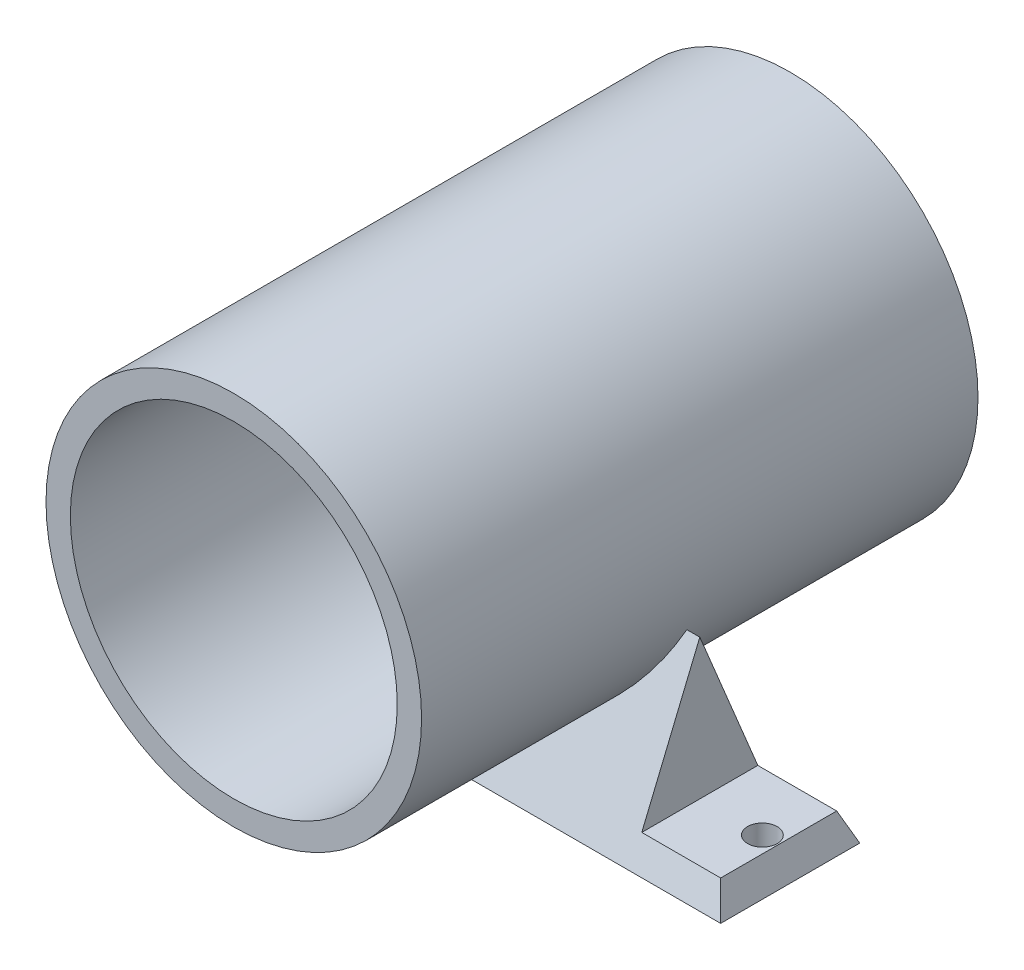
ISO-10303-21;
HEADER;
FILE_DESCRIPTION(('STEP AP214'),'2;1');
FILE_NAME('part.step','',(''),(''),'','','');
FILE_SCHEMA(('AUTOMOTIVE_DESIGN { 1 0 10303 214 1 1 1 1 }'));
ENDSEC;
DATA;
#1=APPLICATION_CONTEXT('core data for automotive mechanical design processes');
#2=APPLICATION_PROTOCOL_DEFINITION('international standard','automotive_design',2000,#1);
#3=PRODUCT_CONTEXT('',#1,'mechanical');
#4=PRODUCT('Part','Part','',(#3));
#5=PRODUCT_RELATED_PRODUCT_CATEGORY('part','',(#4));
#6=PRODUCT_DEFINITION_FORMATION('','',#4);
#7=PRODUCT_DEFINITION_CONTEXT('part definition',#1,'design');
#8=PRODUCT_DEFINITION('design','',#6,#7);
#9=PRODUCT_DEFINITION_SHAPE('','',#8);
#10=(LENGTH_UNIT() NAMED_UNIT(*) SI_UNIT(.MILLI.,.METRE.));
#11=(NAMED_UNIT(*) PLANE_ANGLE_UNIT() SI_UNIT($,.RADIAN.));
#12=(NAMED_UNIT(*) SI_UNIT($,.STERADIAN.) SOLID_ANGLE_UNIT());
#13=UNCERTAINTY_MEASURE_WITH_UNIT(LENGTH_MEASURE(1.E-05),#10,'distance_accuracy_value','');
#14=(GEOMETRIC_REPRESENTATION_CONTEXT(3) GLOBAL_UNCERTAINTY_ASSIGNED_CONTEXT((#13)) GLOBAL_UNIT_ASSIGNED_CONTEXT((#10,
#11,#12)) REPRESENTATION_CONTEXT('',''));
#15=CARTESIAN_POINT('',(0.,0.,0.));
#16=DIRECTION('',(0.,0.,1.));
#17=DIRECTION('',(1.,0.,0.));
#18=AXIS2_PLACEMENT_3D('',#15,#16,#17);
#19=CARTESIAN_POINT('',(-63.5,-53.975,-15.875));
#20=DIRECTION('',(0.,0.382683432365091,-0.923879532511286));
#21=DIRECTION('',(0.,0.923879532511287,0.382683432365091));
#22=AXIS2_PLACEMENT_3D('',#19,#20,#21);
#23=PLANE('',#22);
#24=DIRECTION('',(0.,-0.923879532511287,-0.382683432365091));
#25=VECTOR('',#24,1.);
#26=CARTESIAN_POINT('',(42.8625,-53.975,-15.875));
#27=LINE('',#26,#25);
#28=CARTESIAN_POINT('',(42.8625,-47.625,-13.2447438789308));
#29=VERTEX_POINT('',#28);
#30=CARTESIAN_POINT('',(42.8625,-15.6493596973272,0.));
#31=VERTEX_POINT('',#30);
#32=EDGE_CURVE('E185',#29,#31,#27,.F.);
#33=ORIENTED_EDGE('',*,*,#32,.F.);
#34=DIRECTION('',(1.,0.,0.));
#35=VECTOR('',#34,1.);
#36=CARTESIAN_POINT('',(-63.5,-47.625,-13.2447438789308));
#37=LINE('',#36,#35);
#38=CARTESIAN_POINT('',(60.8697438789308,-47.625,-13.2447438789308));
#39=VERTEX_POINT('',#38);
#40=EDGE_CURVE('E193',#39,#29,#37,.F.);
#41=ORIENTED_EDGE('',*,*,#40,.F.);
#42=DIRECTION('',(0.357406744336594,-0.862856209461016,-0.357406744336594));
#43=VECTOR('',#42,1.);
#44=CARTESIAN_POINT('',(47.277073226045,-14.8093901609323,0.347926773954999));
#45=LINE('',#44,#43);
#46=CARTESIAN_POINT('',(63.5,-53.975,-15.875));
#47=VERTEX_POINT('',#46);
#48=EDGE_CURVE('E160',#39,#47,#45,.T.);
#49=ORIENTED_EDGE('',*,*,#48,.T.);
#50=DIRECTION('',(-1.,0.,0.));
#51=VECTOR('',#50,1.);
#52=CARTESIAN_POINT('',(-63.5,-53.975,-15.875));
#53=LINE('',#52,#51);
#54=CARTESIAN_POINT('',(-63.5,-53.975,-15.875));
#55=VERTEX_POINT('',#54);
#56=EDGE_CURVE('E177',#47,#55,#53,.T.);
#57=ORIENTED_EDGE('',*,*,#56,.T.);
#58=DIRECTION('',(-0.357406744336594,-0.862856209461016,-0.357406744336594));
#59=VECTOR('',#58,1.);
#60=CARTESIAN_POINT('',(-63.5,-53.975,-15.875));
#61=LINE('',#60,#59);
#62=CARTESIAN_POINT('',(-60.8697438789309,-47.625,-13.2447438789308));
#63=VERTEX_POINT('',#62);
#64=EDGE_CURVE('E157',#63,#55,#61,.T.);
#65=ORIENTED_EDGE('',*,*,#64,.F.);
#66=DIRECTION('',(-1.,0.,0.));
#67=VECTOR('',#66,1.);
#68=CARTESIAN_POINT('',(-63.5,-47.625,-13.2447438789308));
#69=LINE('',#68,#67);
#70=CARTESIAN_POINT('',(-42.8625,-47.625,-13.2447438789308));
#71=VERTEX_POINT('',#70);
#72=EDGE_CURVE('E63',#63,#71,#69,.F.);
#73=ORIENTED_EDGE('',*,*,#72,.T.);
#74=DIRECTION('',(0.,0.923879532511287,0.382683432365091));
#75=VECTOR('',#74,1.);
#76=CARTESIAN_POINT('',(-42.8625,-53.975,-15.875));
#77=LINE('',#76,#75);
#78=CARTESIAN_POINT('',(-42.8625,-15.6493596973272,0.));
#79=VERTEX_POINT('',#78);
#80=EDGE_CURVE('E118',#79,#71,#77,.F.);
#81=ORIENTED_EDGE('',*,*,#80,.F.);
#82=DIRECTION('',(1.,0.,0.));
#83=VECTOR('',#82,1.);
#84=CARTESIAN_POINT('',(-63.5,-15.6493596973272,0.));
#85=LINE('',#84,#83);
#86=CARTESIAN_POINT('',(-39.9035267528282,-15.6493596973272,0.));
#87=VERTEX_POINT('',#86);
#88=EDGE_CURVE('E126',#79,#87,#85,.T.);
#89=ORIENTED_EDGE('',*,*,#88,.T.);
#90=CARTESIAN_POINT('',(0.,0.,6.48217702908786));
#91=DIRECTION('',(0.,0.382683432365091,-0.923879532511286));
#92=DIRECTION('',(0.,-0.923879532511287,-0.382683432365091));
#93=AXIS2_PLACEMENT_3D('',#90,#91,#92);
#94=ELLIPSE('',#93,46.3940356850328,42.8625);
#95=CARTESIAN_POINT('',(39.9035267528281,-15.6493596973272,0.));
#96=VERTEX_POINT('',#95);
#97=EDGE_CURVE('E153',#96,#87,#94,.T.);
#98=ORIENTED_EDGE('',*,*,#97,.F.);
#99=EDGE_CURVE('E156',#96,#31,#85,.T.);
#100=ORIENTED_EDGE('',*,*,#99,.T.);
#101=EDGE_LOOP('',(#33,#41,#49,#57,#65,#73,#81,#89,#98,#100));
#102=FACE_BOUND('',#101,.T.);
#103=ADVANCED_FACE('F39',(#102),#23,.T.);
#104=CARTESIAN_POINT('',(-63.5,-53.975,15.875));
#105=DIRECTION('',(0.,0.382683432365091,0.923879532511286));
#106=DIRECTION('',(0.,-0.923879532511287,0.382683432365091));
#107=AXIS2_PLACEMENT_3D('',#104,#105,#106);
#108=PLANE('',#107);
#109=DIRECTION('',(0.,0.923879532511287,-0.382683432365091));
#110=VECTOR('',#109,1.);
#111=CARTESIAN_POINT('',(42.8625,-53.975,15.875));
#112=LINE('',#111,#110);
#113=CARTESIAN_POINT('',(42.8625,-47.625,13.2447438789308));
#114=VERTEX_POINT('',#113);
#115=EDGE_CURVE('E11',#31,#114,#112,.F.);
#116=ORIENTED_EDGE('',*,*,#115,.F.);
#117=ORIENTED_EDGE('',*,*,#99,.F.);
#118=CARTESIAN_POINT('',(0.,0.,-6.48217702908785));
#119=DIRECTION('',(0.,0.382683432365091,0.923879532511286));
#120=DIRECTION('',(0.,0.923879532511287,-0.382683432365091));
#121=AXIS2_PLACEMENT_3D('',#118,#119,#120);
#122=ELLIPSE('',#121,46.3940356850328,42.8625);
#123=EDGE_CURVE('E147',#87,#96,#122,.T.);
#124=ORIENTED_EDGE('',*,*,#123,.F.);
#125=ORIENTED_EDGE('',*,*,#88,.F.);
#126=DIRECTION('',(0.,-0.923879532511287,0.382683432365091));
#127=VECTOR('',#126,1.);
#128=CARTESIAN_POINT('',(-42.8625,-53.975,15.875));
#129=LINE('',#128,#127);
#130=CARTESIAN_POINT('',(-42.8625,-47.625,13.2447438789308));
#131=VERTEX_POINT('',#130);
#132=EDGE_CURVE('E48',#131,#79,#129,.F.);
#133=ORIENTED_EDGE('',*,*,#132,.F.);
#134=DIRECTION('',(1.,0.,0.));
#135=VECTOR('',#134,1.);
#136=CARTESIAN_POINT('',(-63.5,-47.625,13.2447438789308));
#137=LINE('',#136,#135);
#138=CARTESIAN_POINT('',(-60.8697438789309,-47.625,13.2447438789308));
#139=VERTEX_POINT('',#138);
#140=EDGE_CURVE('E104',#131,#139,#137,.F.);
#141=ORIENTED_EDGE('',*,*,#140,.T.);
#142=DIRECTION('',(-0.357406744336594,-0.862856209461016,0.357406744336594));
#143=VECTOR('',#142,1.);
#144=CARTESIAN_POINT('',(-63.5,-53.975,15.875));
#145=LINE('',#144,#143);
#146=CARTESIAN_POINT('',(-63.5,-53.975,15.875));
#147=VERTEX_POINT('',#146);
#148=EDGE_CURVE('E161',#139,#147,#145,.T.);
#149=ORIENTED_EDGE('',*,*,#148,.T.);
#150=DIRECTION('',(1.,0.,0.));
#151=VECTOR('',#150,1.);
#152=CARTESIAN_POINT('',(-63.5,-53.975,15.875));
#153=LINE('',#152,#151);
#154=CARTESIAN_POINT('',(63.5,-53.975,15.875));
#155=VERTEX_POINT('',#154);
#156=EDGE_CURVE('E167',#147,#155,#153,.T.);
#157=ORIENTED_EDGE('',*,*,#156,.T.);
#158=DIRECTION('',(0.357406744336594,-0.862856209461016,0.357406744336594));
#159=VECTOR('',#158,1.);
#160=CARTESIAN_POINT('',(59.4442683065112,-44.1835975402331,11.8192683065113));
#161=LINE('',#160,#159);
#162=CARTESIAN_POINT('',(60.8697438789308,-47.625,13.2447438789308));
#163=VERTEX_POINT('',#162);
#164=EDGE_CURVE('E164',#163,#155,#161,.T.);
#165=ORIENTED_EDGE('',*,*,#164,.F.);
#166=DIRECTION('',(-1.,0.,0.));
#167=VECTOR('',#166,1.);
#168=CARTESIAN_POINT('',(-63.5,-47.625,13.2447438789308));
#169=LINE('',#168,#167);
#170=EDGE_CURVE('E55',#114,#163,#169,.F.);
#171=ORIENTED_EDGE('',*,*,#170,.F.);
#172=EDGE_LOOP('',(#116,#117,#124,#125,#133,#141,#149,#157,#165,#171));
#173=FACE_BOUND('',#172,.T.);
#174=ADVANCED_FACE('F124',(#173),#108,.T.);
#175=CARTESIAN_POINT('',(63.5,-53.975,-15.875));
#176=DIRECTION('',(0.923879532511286,0.382683432365091,0.));
#177=DIRECTION('',(-0.382683432365091,0.923879532511287,0.));
#178=AXIS2_PLACEMENT_3D('',#175,#176,#177);
#179=PLANE('',#178);
#180=DIRECTION('',(0.,0.,1.));
#181=VECTOR('',#180,1.);
#182=CARTESIAN_POINT('',(60.8697438789308,-47.625,-15.875));
#183=LINE('',#182,#181);
#184=EDGE_CURVE('E128',#163,#39,#183,.F.);
#185=ORIENTED_EDGE('',*,*,#184,.F.);
#186=ORIENTED_EDGE('',*,*,#164,.T.);
#187=DIRECTION('',(0.,0.,-1.));
#188=VECTOR('',#187,1.);
#189=CARTESIAN_POINT('',(63.5,-53.975,-15.875));
#190=LINE('',#189,#188);
#191=EDGE_CURVE('E181',#155,#47,#190,.T.);
#192=ORIENTED_EDGE('',*,*,#191,.T.);
#193=ORIENTED_EDGE('',*,*,#48,.F.);
#194=EDGE_LOOP('',(#185,#186,#192,#193));
#195=FACE_BOUND('',#194,.T.);
#196=ADVANCED_FACE('F238',(#195),#179,.T.);
#197=CARTESIAN_POINT('',(0.,0.,63.5));
#198=DIRECTION('',(0.,0.,-1.));
#199=DIRECTION('',(-1.,0.,0.));
#200=AXIS2_PLACEMENT_3D('',#197,#198,#199);
#201=CYLINDRICAL_SURFACE('',#200,42.8625);
#202=CARTESIAN_POINT('',(0.,0.,-63.5));
#203=DIRECTION('',(0.,0.,1.));
#204=DIRECTION('',(1.,0.,0.));
#205=AXIS2_PLACEMENT_3D('',#202,#203,#204);
#206=CIRCLE('',#205,42.8625);
#207=CARTESIAN_POINT('',(42.8625,0.,-63.5));
#208=VERTEX_POINT('',#207);
#209=EDGE_CURVE('E135',#208,#208,#206,.T.);
#210=ORIENTED_EDGE('',*,*,#209,.T.);
#211=EDGE_LOOP('',(#210));
#212=FACE_BOUND('',#211,.T.);
#213=CARTESIAN_POINT('',(0.,0.,63.5));
#214=DIRECTION('',(0.,0.,1.));
#215=DIRECTION('',(1.,0.,0.));
#216=AXIS2_PLACEMENT_3D('',#213,#214,#215);
#217=CIRCLE('',#216,42.8625);
#218=CARTESIAN_POINT('',(42.8625,0.,63.5));
#219=VERTEX_POINT('',#218);
#220=EDGE_CURVE('E134',#219,#219,#217,.T.);
#221=ORIENTED_EDGE('',*,*,#220,.F.);
#222=EDGE_LOOP('',(#221));
#223=FACE_BOUND('',#222,.T.);
#224=ORIENTED_EDGE('',*,*,#97,.T.);
#225=ORIENTED_EDGE('',*,*,#123,.T.);
#226=EDGE_LOOP('',(#224,#225));
#227=FACE_BOUND('',#226,.T.);
#228=ADVANCED_FACE('F41',(#212,#223,#227),#201,.T.);
#229=CARTESIAN_POINT('',(0.,0.,63.5));
#230=DIRECTION('',(0.,0.,1.));
#231=DIRECTION('',(1.,0.,0.));
#232=AXIS2_PLACEMENT_3D('',#229,#230,#231);
#233=PLANE('',#232);
#234=ORIENTED_EDGE('',*,*,#220,.T.);
#235=EDGE_LOOP('',(#234));
#236=FACE_BOUND('',#235,.T.);
#237=CARTESIAN_POINT('',(0.,0.,63.5));
#238=DIRECTION('',(0.,0.,1.));
#239=DIRECTION('',(1.,0.,0.));
#240=AXIS2_PLACEMENT_3D('',#237,#238,#239);
#241=CIRCLE('',#240,37.30625);
#242=CARTESIAN_POINT('',(37.30625,0.,63.5));
#243=VERTEX_POINT('',#242);
#244=EDGE_CURVE('E139',#243,#243,#241,.T.);
#245=ORIENTED_EDGE('',*,*,#244,.F.);
#246=EDGE_LOOP('',(#245));
#247=FACE_BOUND('',#246,.T.);
#248=ADVANCED_FACE('F249',(#236,#247),#233,.T.);
#249=CARTESIAN_POINT('',(0.,0.,-63.5));
#250=DIRECTION('',(0.,0.,1.));
#251=DIRECTION('',(1.,0.,0.));
#252=AXIS2_PLACEMENT_3D('',#249,#250,#251);
#253=PLANE('',#252);
#254=ORIENTED_EDGE('',*,*,#209,.F.);
#255=EDGE_LOOP('',(#254));
#256=FACE_BOUND('',#255,.T.);
#257=CARTESIAN_POINT('',(0.,0.,-63.5));
#258=DIRECTION('',(0.,0.,1.));
#259=DIRECTION('',(1.,0.,0.));
#260=AXIS2_PLACEMENT_3D('',#257,#258,#259);
#261=CIRCLE('',#260,37.30625);
#262=CARTESIAN_POINT('',(37.30625,0.,-63.5));
#263=VERTEX_POINT('',#262);
#264=EDGE_CURVE('E143',#263,#263,#261,.T.);
#265=ORIENTED_EDGE('',*,*,#264,.T.);
#266=EDGE_LOOP('',(#265));
#267=FACE_BOUND('',#266,.T.);
#268=ADVANCED_FACE('F247',(#256,#267),#253,.F.);
#269=CARTESIAN_POINT('',(0.,0.,63.5));
#270=DIRECTION('',(0.,0.,-1.));
#271=DIRECTION('',(-1.,0.,0.));
#272=AXIS2_PLACEMENT_3D('',#269,#270,#271);
#273=CYLINDRICAL_SURFACE('',#272,37.30625);
#274=ORIENTED_EDGE('',*,*,#244,.T.);
#275=EDGE_LOOP('',(#274));
#276=FACE_BOUND('',#275,.T.);
#277=ORIENTED_EDGE('',*,*,#264,.F.);
#278=EDGE_LOOP('',(#277));
#279=FACE_BOUND('',#278,.T.);
#280=ADVANCED_FACE('F244',(#276,#279),#273,.F.);
#281=CARTESIAN_POINT('',(-63.5,-53.975,-15.875));
#282=DIRECTION('',(-0.923879532511286,0.382683432365091,0.));
#283=DIRECTION('',(-0.382683432365091,-0.923879532511287,0.));
#284=AXIS2_PLACEMENT_3D('',#281,#282,#283);
#285=PLANE('',#284);
#286=ORIENTED_EDGE('',*,*,#148,.F.);
#287=DIRECTION('',(0.,0.,1.));
#288=VECTOR('',#287,1.);
#289=CARTESIAN_POINT('',(-60.8697438789309,-47.625,-15.875));
#290=LINE('',#289,#288);
#291=EDGE_CURVE('E108',#139,#63,#290,.F.);
#292=ORIENTED_EDGE('',*,*,#291,.T.);
#293=ORIENTED_EDGE('',*,*,#64,.T.);
#294=DIRECTION('',(0.,0.,1.));
#295=VECTOR('',#294,1.);
#296=CARTESIAN_POINT('',(-63.5,-53.975,-15.875));
#297=LINE('',#296,#295);
#298=EDGE_CURVE('E173',#55,#147,#297,.T.);
#299=ORIENTED_EDGE('',*,*,#298,.T.);
#300=EDGE_LOOP('',(#286,#292,#293,#299));
#301=FACE_BOUND('',#300,.T.);
#302=ADVANCED_FACE('F243',(#301),#285,.T.);
#303=CARTESIAN_POINT('',(0.,-53.975,0.));
#304=DIRECTION('',(0.,1.,0.));
#305=DIRECTION('',(0.,0.,1.));
#306=AXIS2_PLACEMENT_3D('',#303,#304,#305);
#307=PLANE('',#306);
#308=CARTESIAN_POINT('',(-57.15,-53.975,0.));
#309=DIRECTION('',(0.,1.,0.));
#310=DIRECTION('',(0.,0.,1.));
#311=AXIS2_PLACEMENT_3D('',#308,#309,#310);
#312=CIRCLE('',#311,3.37819999999994);
#313=CARTESIAN_POINT('',(-57.15,-53.975,3.37819999999995));
#314=VERTEX_POINT('',#313);
#315=EDGE_CURVE('E209',#314,#314,#312,.T.);
#316=ORIENTED_EDGE('',*,*,#315,.T.);
#317=EDGE_LOOP('',(#316));
#318=FACE_BOUND('',#317,.T.);
#319=CARTESIAN_POINT('',(57.15,-53.975,0.));
#320=DIRECTION('',(0.,1.,0.));
#321=DIRECTION('',(0.,0.,1.));
#322=AXIS2_PLACEMENT_3D('',#319,#320,#321);
#323=CIRCLE('',#322,3.37819999999994);
#324=CARTESIAN_POINT('',(57.15,-53.975,3.37819999999995));
#325=VERTEX_POINT('',#324);
#326=EDGE_CURVE('E120',#325,#325,#323,.T.);
#327=ORIENTED_EDGE('',*,*,#326,.T.);
#328=EDGE_LOOP('',(#327));
#329=FACE_BOUND('',#328,.T.);
#330=ORIENTED_EDGE('',*,*,#191,.F.);
#331=ORIENTED_EDGE('',*,*,#156,.F.);
#332=ORIENTED_EDGE('',*,*,#298,.F.);
#333=ORIENTED_EDGE('',*,*,#56,.F.);
#334=EDGE_LOOP('',(#330,#331,#332,#333));
#335=FACE_BOUND('',#334,.T.);
#336=ADVANCED_FACE('F230',(#318,#329,#335),#307,.F.);
#337=CARTESIAN_POINT('',(-42.8625,42.8625,-15.875));
#338=DIRECTION('',(-1.,0.,0.));
#339=DIRECTION('',(0.,0.,1.));
#340=AXIS2_PLACEMENT_3D('',#337,#338,#339);
#341=PLANE('',#340);
#342=ORIENTED_EDGE('',*,*,#80,.T.);
#343=DIRECTION('',(0.,0.,-1.));
#344=VECTOR('',#343,1.);
#345=CARTESIAN_POINT('',(-42.8625,-47.625,-15.875));
#346=LINE('',#345,#344);
#347=EDGE_CURVE('E107',#131,#71,#346,.T.);
#348=ORIENTED_EDGE('',*,*,#347,.F.);
#349=ORIENTED_EDGE('',*,*,#132,.T.);
#350=EDGE_LOOP('',(#342,#348,#349));
#351=FACE_BOUND('',#350,.T.);
#352=ADVANCED_FACE('F116',(#351),#341,.T.);
#353=CARTESIAN_POINT('',(0.,-47.625,0.));
#354=DIRECTION('',(0.,-1.,0.));
#355=DIRECTION('',(0.,0.,-1.));
#356=AXIS2_PLACEMENT_3D('',#353,#354,#355);
#357=PLANE('',#356);
#358=CARTESIAN_POINT('',(-57.15,-47.625,0.));
#359=DIRECTION('',(0.,1.,0.));
#360=DIRECTION('',(0.,0.,1.));
#361=AXIS2_PLACEMENT_3D('',#358,#359,#360);
#362=CIRCLE('',#361,3.37819999999994);
#363=CARTESIAN_POINT('',(-57.15,-47.625,3.37819999999995));
#364=VERTEX_POINT('',#363);
#365=EDGE_CURVE('E213',#364,#364,#362,.T.);
#366=ORIENTED_EDGE('',*,*,#365,.F.);
#367=EDGE_LOOP('',(#366));
#368=FACE_BOUND('',#367,.T.);
#369=ORIENTED_EDGE('',*,*,#291,.F.);
#370=ORIENTED_EDGE('',*,*,#140,.F.);
#371=ORIENTED_EDGE('',*,*,#347,.T.);
#372=ORIENTED_EDGE('',*,*,#72,.F.);
#373=EDGE_LOOP('',(#369,#370,#371,#372));
#374=FACE_BOUND('',#373,.T.);
#375=ADVANCED_FACE('F106',(#368,#374),#357,.F.);
#376=CARTESIAN_POINT('',(42.8625,42.8625,-15.875));
#377=DIRECTION('',(1.,0.,0.));
#378=DIRECTION('',(0.,0.,-1.));
#379=AXIS2_PLACEMENT_3D('',#376,#377,#378);
#380=PLANE('',#379);
#381=ORIENTED_EDGE('',*,*,#32,.T.);
#382=ORIENTED_EDGE('',*,*,#115,.T.);
#383=DIRECTION('',(0.,0.,1.));
#384=VECTOR('',#383,1.);
#385=CARTESIAN_POINT('',(42.8625,-47.625,-15.875));
#386=LINE('',#385,#384);
#387=EDGE_CURVE('E113',#29,#114,#386,.T.);
#388=ORIENTED_EDGE('',*,*,#387,.F.);
#389=EDGE_LOOP('',(#381,#382,#388));
#390=FACE_BOUND('',#389,.T.);
#391=ADVANCED_FACE('F221',(#390),#380,.T.);
#392=CARTESIAN_POINT('',(0.,-47.625,0.));
#393=DIRECTION('',(0.,1.,0.));
#394=DIRECTION('',(0.,0.,1.));
#395=AXIS2_PLACEMENT_3D('',#392,#393,#394);
#396=PLANE('',#395);
#397=CARTESIAN_POINT('',(57.15,-47.625,0.));
#398=DIRECTION('',(0.,1.,0.));
#399=DIRECTION('',(0.,0.,1.));
#400=AXIS2_PLACEMENT_3D('',#397,#398,#399);
#401=CIRCLE('',#400,3.37819999999994);
#402=CARTESIAN_POINT('',(57.15,-47.625,3.37819999999995));
#403=VERTEX_POINT('',#402);
#404=EDGE_CURVE('E205',#403,#403,#401,.T.);
#405=ORIENTED_EDGE('',*,*,#404,.F.);
#406=EDGE_LOOP('',(#405));
#407=FACE_BOUND('',#406,.T.);
#408=ORIENTED_EDGE('',*,*,#40,.T.);
#409=ORIENTED_EDGE('',*,*,#387,.T.);
#410=ORIENTED_EDGE('',*,*,#170,.T.);
#411=ORIENTED_EDGE('',*,*,#184,.T.);
#412=EDGE_LOOP('',(#408,#409,#410,#411));
#413=FACE_BOUND('',#412,.T.);
#414=ADVANCED_FACE('F227',(#407,#413),#396,.T.);
#415=CARTESIAN_POINT('',(57.15,-47.625,0.));
#416=DIRECTION('',(0.,1.,0.));
#417=DIRECTION('',(0.,0.,1.));
#418=AXIS2_PLACEMENT_3D('',#415,#416,#417);
#419=CYLINDRICAL_SURFACE('',#418,3.37819999999994);
#420=ORIENTED_EDGE('',*,*,#326,.F.);
#421=EDGE_LOOP('',(#420));
#422=FACE_BOUND('',#421,.T.);
#423=ORIENTED_EDGE('',*,*,#404,.T.);
#424=EDGE_LOOP('',(#423));
#425=FACE_BOUND('',#424,.T.);
#426=ADVANCED_FACE('F356',(#422,#425),#419,.F.);
#427=CARTESIAN_POINT('',(-57.15,-47.625,0.));
#428=DIRECTION('',(0.,1.,0.));
#429=DIRECTION('',(0.,0.,1.));
#430=AXIS2_PLACEMENT_3D('',#427,#428,#429);
#431=CYLINDRICAL_SURFACE('',#430,3.37819999999994);
#432=ORIENTED_EDGE('',*,*,#315,.F.);
#433=EDGE_LOOP('',(#432));
#434=FACE_BOUND('',#433,.T.);
#435=ORIENTED_EDGE('',*,*,#365,.T.);
#436=EDGE_LOOP('',(#435));
#437=FACE_BOUND('',#436,.T.);
#438=ADVANCED_FACE('F218',(#434,#437),#431,.F.);
#439=CLOSED_SHELL('',(#103,#174,#196,#228,#248,#268,#280,#302,#336,#352,#375,#391,#414,#426,#438));
#440=MANIFOLD_SOLID_BREP('B2',#439);
#441=ADVANCED_BREP_SHAPE_REPRESENTATION('',(#18,#440),#14);
#442=SHAPE_DEFINITION_REPRESENTATION(#9,#441);
ENDSEC;
END-ISO-10303-21;
